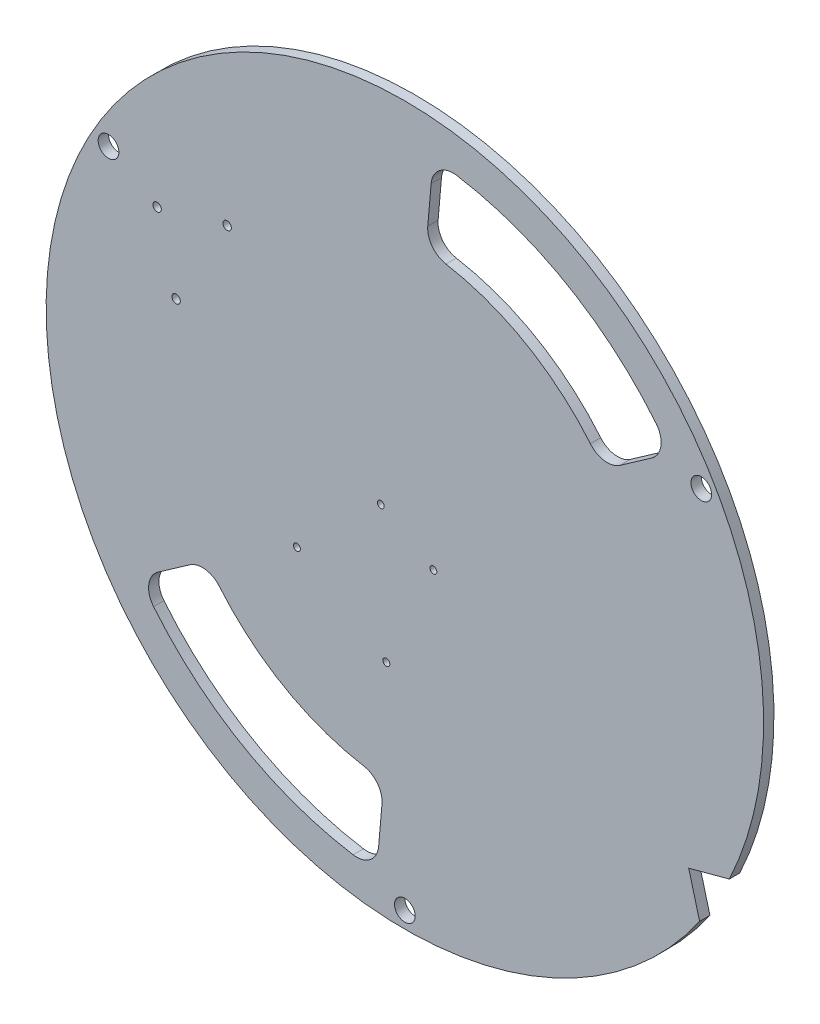
ISO-10303-21;
HEADER;
FILE_DESCRIPTION(('STEP AP214'),'2;1');
FILE_NAME('part.step','',(''),(''),'','','');
FILE_SCHEMA(('AUTOMOTIVE_DESIGN { 1 0 10303 214 1 1 1 1 }'));
ENDSEC;
DATA;
#1=APPLICATION_CONTEXT('core data for automotive mechanical design processes');
#2=APPLICATION_PROTOCOL_DEFINITION('international standard','automotive_design',2000,#1);
#3=PRODUCT_CONTEXT('',#1,'mechanical');
#4=PRODUCT('Part','Part','',(#3));
#5=PRODUCT_RELATED_PRODUCT_CATEGORY('part','',(#4));
#6=PRODUCT_DEFINITION_FORMATION('','',#4);
#7=PRODUCT_DEFINITION_CONTEXT('part definition',#1,'design');
#8=PRODUCT_DEFINITION('design','',#6,#7);
#9=PRODUCT_DEFINITION_SHAPE('','',#8);
#10=(LENGTH_UNIT() NAMED_UNIT(*) SI_UNIT(.MILLI.,.METRE.));
#11=(NAMED_UNIT(*) PLANE_ANGLE_UNIT() SI_UNIT($,.RADIAN.));
#12=(NAMED_UNIT(*) SI_UNIT($,.STERADIAN.) SOLID_ANGLE_UNIT());
#13=UNCERTAINTY_MEASURE_WITH_UNIT(LENGTH_MEASURE(1.E-05),#10,'distance_accuracy_value','');
#14=(GEOMETRIC_REPRESENTATION_CONTEXT(3) GLOBAL_UNCERTAINTY_ASSIGNED_CONTEXT((#13)) GLOBAL_UNIT_ASSIGNED_CONTEXT((#10,
#11,#12)) REPRESENTATION_CONTEXT('',''));
#15=CARTESIAN_POINT('',(0.,0.,0.));
#16=DIRECTION('',(0.,0.,1.));
#17=DIRECTION('',(1.,0.,0.));
#18=AXIS2_PLACEMENT_3D('',#15,#16,#17);
#19=CARTESIAN_POINT('',(0.,0.,4.762));
#20=DIRECTION('',(0.,0.,-1.));
#21=DIRECTION('',(-1.,0.,0.));
#22=AXIS2_PLACEMENT_3D('',#19,#20,#21);
#23=CYLINDRICAL_SURFACE('',#22,165.1);
#24=CARTESIAN_POINT('',(0.,0.,0.));
#25=DIRECTION('',(0.,0.,1.));
#26=DIRECTION('',(1.,0.,0.));
#27=AXIS2_PLACEMENT_3D('',#24,#25,#26);
#28=CIRCLE('',#27,165.1);
#29=CARTESIAN_POINT('',(149.333554499948,-70.4095128545209,0.));
#30=VERTEX_POINT('',#29);
#31=CARTESIAN_POINT('',(135.643204050077,-94.1218954071221,0.));
#32=VERTEX_POINT('',#31);
#33=EDGE_CURVE('E382',#30,#32,#28,.T.);
#34=ORIENTED_EDGE('',*,*,#33,.T.);
#35=DIRECTION('',(0.,0.,-1.));
#36=VECTOR('',#35,1.);
#37=CARTESIAN_POINT('',(135.643204050077,-94.1218954071221,4.762));
#38=LINE('',#37,#36);
#39=CARTESIAN_POINT('',(135.643204050077,-94.1218954071221,4.762));
#40=VERTEX_POINT('',#39);
#41=EDGE_CURVE('E12',#40,#32,#38,.T.);
#42=ORIENTED_EDGE('',*,*,#41,.F.);
#43=CARTESIAN_POINT('',(0.,0.,4.762));
#44=DIRECTION('',(0.,0.,1.));
#45=DIRECTION('',(1.,0.,0.));
#46=AXIS2_PLACEMENT_3D('',#43,#44,#45);
#47=CIRCLE('',#46,165.1);
#48=CARTESIAN_POINT('',(149.333554499948,-70.4095128545209,4.762));
#49=VERTEX_POINT('',#48);
#50=EDGE_CURVE('E365',#49,#40,#47,.T.);
#51=ORIENTED_EDGE('',*,*,#50,.F.);
#52=DIRECTION('',(0.,0.,-1.));
#53=VECTOR('',#52,1.);
#54=CARTESIAN_POINT('',(149.333554499948,-70.4095128545209,4.762));
#55=LINE('',#54,#53);
#56=EDGE_CURVE('E373',#49,#30,#55,.T.);
#57=ORIENTED_EDGE('',*,*,#56,.T.);
#58=EDGE_LOOP('',(#34,#42,#51,#57));
#59=FACE_BOUND('',#58,.T.);
#60=ADVANCED_FACE('F45',(#59),#23,.T.);
#61=CARTESIAN_POINT('',(103.026358452299,27.6058295464129,4.762));
#62=DIRECTION('',(0.965925826289068,0.25881904510252,0.));
#63=DIRECTION('',(-0.25881904510252,0.965925826289068,0.));
#64=AXIS2_PLACEMENT_3D('',#61,#62,#63);
#65=PLANE('',#64);
#66=DIRECTION('',(0.25881904510252,-0.965925826289068,0.));
#67=VECTOR('',#66,1.);
#68=CARTESIAN_POINT('',(103.026358452299,27.6058295464129,0.));
#69=LINE('',#68,#67);
#70=CARTESIAN_POINT('',(130.632187998712,-75.4205289058857,0.));
#71=VERTEX_POINT('',#70);
#72=EDGE_CURVE('E386',#71,#32,#69,.T.);
#73=ORIENTED_EDGE('',*,*,#72,.F.);
#74=DIRECTION('',(0.,0.,-1.));
#75=VECTOR('',#74,1.);
#76=CARTESIAN_POINT('',(130.632187998712,-75.4205289058857,4.762));
#77=LINE('',#76,#75);
#78=CARTESIAN_POINT('',(130.632187998712,-75.4205289058857,4.762));
#79=VERTEX_POINT('',#78);
#80=EDGE_CURVE('E53',#79,#71,#77,.T.);
#81=ORIENTED_EDGE('',*,*,#80,.F.);
#82=DIRECTION('',(0.25881904510252,-0.965925826289068,0.));
#83=VECTOR('',#82,1.);
#84=CARTESIAN_POINT('',(103.026358452299,27.6058295464129,4.762));
#85=LINE('',#84,#83);
#86=EDGE_CURVE('E368',#79,#40,#85,.T.);
#87=ORIENTED_EDGE('',*,*,#86,.T.);
#88=ORIENTED_EDGE('',*,*,#41,.T.);
#89=EDGE_LOOP('',(#73,#81,#87,#88));
#90=FACE_BOUND('',#89,.T.);
#91=ADVANCED_FACE('F401',(#90),#65,.T.);
#92=CARTESIAN_POINT('',(136.399001061409,78.7499999799987,4.762));
#93=DIRECTION('',(0.,0.,-1.));
#94=DIRECTION('',(-1.,0.,0.));
#95=AXIS2_PLACEMENT_3D('',#92,#93,#94);
#96=CYLINDRICAL_SURFACE('',#95,4.76250000002167);
#97=CARTESIAN_POINT('',(136.399001061409,78.7499999799987,4.762));
#98=DIRECTION('',(0.,0.,1.));
#99=DIRECTION('',(1.,0.,0.));
#100=AXIS2_PLACEMENT_3D('',#97,#98,#99);
#101=CIRCLE('',#100,4.76250000002167);
#102=CARTESIAN_POINT('',(141.161501061431,78.7499999799987,4.762));
#103=VERTEX_POINT('',#102);
#104=EDGE_CURVE('E361',#103,#103,#101,.T.);
#105=ORIENTED_EDGE('',*,*,#104,.T.);
#106=EDGE_LOOP('',(#105));
#107=FACE_BOUND('',#106,.T.);
#108=CARTESIAN_POINT('',(136.399001061409,78.7499999799987,0.));
#109=DIRECTION('',(0.,0.,1.));
#110=DIRECTION('',(1.,0.,0.));
#111=AXIS2_PLACEMENT_3D('',#108,#109,#110);
#112=CIRCLE('',#111,4.76250000002167);
#113=CARTESIAN_POINT('',(141.161501061431,78.7499999799987,0.));
#114=VERTEX_POINT('',#113);
#115=EDGE_CURVE('E379',#114,#114,#112,.T.);
#116=ORIENTED_EDGE('',*,*,#115,.F.);
#117=EDGE_LOOP('',(#116));
#118=FACE_BOUND('',#117,.T.);
#119=ADVANCED_FACE('F424',(#107,#118),#96,.F.);
#120=CARTESIAN_POINT('',(0.,-157.49999996,4.762));
#121=DIRECTION('',(0.,0.,-1.));
#122=DIRECTION('',(-1.,0.,0.));
#123=AXIS2_PLACEMENT_3D('',#120,#121,#122);
#124=CYLINDRICAL_SURFACE('',#123,4.76250000002168);
#125=CARTESIAN_POINT('',(0.,-157.49999996,4.762));
#126=DIRECTION('',(0.,0.,1.));
#127=DIRECTION('',(1.,0.,0.));
#128=AXIS2_PLACEMENT_3D('',#125,#126,#127);
#129=CIRCLE('',#128,4.76250000002168);
#130=CARTESIAN_POINT('',(4.7625000000217,-157.49999996,4.762));
#131=VERTEX_POINT('',#130);
#132=EDGE_CURVE('E356',#131,#131,#129,.T.);
#133=ORIENTED_EDGE('',*,*,#132,.T.);
#134=EDGE_LOOP('',(#133));
#135=FACE_BOUND('',#134,.T.);
#136=CARTESIAN_POINT('',(0.,-157.49999996,0.));
#137=DIRECTION('',(0.,0.,1.));
#138=DIRECTION('',(1.,0.,0.));
#139=AXIS2_PLACEMENT_3D('',#136,#137,#138);
#140=CIRCLE('',#139,4.76250000002168);
#141=CARTESIAN_POINT('',(4.7625000000217,-157.49999996,0.));
#142=VERTEX_POINT('',#141);
#143=EDGE_CURVE('E376',#142,#142,#140,.T.);
#144=ORIENTED_EDGE('',*,*,#143,.F.);
#145=EDGE_LOOP('',(#144));
#146=FACE_BOUND('',#145,.T.);
#147=ADVANCED_FACE('F428',(#135,#146),#124,.F.);
#148=CARTESIAN_POINT('',(-136.399001061408,78.7499999800007,4.762));
#149=DIRECTION('',(0.,0.,-1.));
#150=DIRECTION('',(-1.,0.,0.));
#151=AXIS2_PLACEMENT_3D('',#148,#149,#150);
#152=CYLINDRICAL_SURFACE('',#151,4.7625000000217);
#153=CARTESIAN_POINT('',(-136.399001061408,78.7499999800007,4.762));
#154=DIRECTION('',(0.,0.,1.));
#155=DIRECTION('',(1.,0.,0.));
#156=AXIS2_PLACEMENT_3D('',#153,#154,#155);
#157=CIRCLE('',#156,4.7625000000217);
#158=CARTESIAN_POINT('',(-131.636501061386,78.7499999800007,4.762));
#159=VERTEX_POINT('',#158);
#160=EDGE_CURVE('E352',#159,#159,#157,.T.);
#161=ORIENTED_EDGE('',*,*,#160,.T.);
#162=EDGE_LOOP('',(#161));
#163=FACE_BOUND('',#162,.T.);
#164=CARTESIAN_POINT('',(-136.399001061408,78.7499999800007,0.));
#165=DIRECTION('',(0.,0.,1.));
#166=DIRECTION('',(1.,0.,0.));
#167=AXIS2_PLACEMENT_3D('',#164,#165,#166);
#168=CIRCLE('',#167,4.7625000000217);
#169=CARTESIAN_POINT('',(-131.636501061386,78.7499999800007,0.));
#170=VERTEX_POINT('',#169);
#171=EDGE_CURVE('E349',#170,#170,#168,.T.);
#172=ORIENTED_EDGE('',*,*,#171,.F.);
#173=EDGE_LOOP('',(#172));
#174=FACE_BOUND('',#173,.T.);
#175=ADVANCED_FACE('F47',(#163,#174),#152,.F.);
#176=CARTESIAN_POINT('',(27.6058295464135,-103.026358452299,4.762));
#177=DIRECTION('',(-0.258819045102526,0.965925826289067,0.));
#178=DIRECTION('',(-0.965925826289067,-0.258819045102526,0.));
#179=AXIS2_PLACEMENT_3D('',#176,#177,#178);
#180=PLANE('',#179);
#181=DIRECTION('',(0.965925826289067,0.258819045102526,0.));
#182=VECTOR('',#181,1.);
#183=CARTESIAN_POINT('',(27.6058295464135,-103.026358452299,0.));
#184=LINE('',#183,#182);
#185=EDGE_CURVE('E357',#71,#30,#184,.T.);
#186=ORIENTED_EDGE('',*,*,#185,.T.);
#187=ORIENTED_EDGE('',*,*,#56,.F.);
#188=DIRECTION('',(0.965925826289067,0.258819045102526,0.));
#189=VECTOR('',#188,1.);
#190=CARTESIAN_POINT('',(27.6058295464135,-103.026358452299,4.762));
#191=LINE('',#190,#189);
#192=EDGE_CURVE('E371',#79,#49,#191,.T.);
#193=ORIENTED_EDGE('',*,*,#192,.F.);
#194=ORIENTED_EDGE('',*,*,#80,.T.);
#195=EDGE_LOOP('',(#186,#187,#193,#194));
#196=FACE_BOUND('',#195,.T.);
#197=ADVANCED_FACE('F394',(#196),#180,.F.);
#198=CARTESIAN_POINT('',(0.,0.,4.762));
#199=DIRECTION('',(0.,0.,1.));
#200=DIRECTION('',(1.,0.,0.));
#201=AXIS2_PLACEMENT_3D('',#198,#199,#200);
#202=PLANE('',#201);
#203=CARTESIAN_POINT('',(-93.1741154605542,-77.6442878333191,4.762));
#204=DIRECTION('',(0.,0.,1.));
#205=DIRECTION('',(-1.,0.,0.));
#206=AXIS2_PLACEMENT_3D('',#203,#204,#205);
#207=CIRCLE('',#206,10.16);
#208=CARTESIAN_POINT('',(-85.3689539560051,-71.1400542975437,4.762));
#209=VERTEX_POINT('',#208);
#210=CARTESIAN_POINT('',(-99.0016520538809,-69.321703063343,4.762));
#211=VERTEX_POINT('',#210);
#212=EDGE_CURVE('E60',#209,#211,#207,.T.);
#213=ORIENTED_EDGE('',*,*,#212,.F.);
#214=CARTESIAN_POINT('',(0.,0.,4.762));
#215=DIRECTION('',(0.,0.,-1.));
#216=DIRECTION('',(-1.,0.,0.));
#217=AXIS2_PLACEMENT_3D('',#214,#215,#216);
#218=CIRCLE('',#217,111.125);
#219=CARTESIAN_POINT('',(-18.9246172702747,-109.501709969176,4.762));
#220=VERTEX_POINT('',#219);
#221=EDGE_CURVE('E194',#220,#209,#218,.T.);
#222=ORIENTED_EDGE('',*,*,#221,.F.);
#223=CARTESIAN_POINT('',(-20.6548679921284,-119.513294880644,4.762));
#224=DIRECTION('',(0.,0.,1.));
#225=DIRECTION('',(1.,0.,0.));
#226=AXIS2_PLACEMENT_3D('',#223,#224,#225);
#227=CIRCLE('',#226,10.16);
#228=CARTESIAN_POINT('',(-10.5335298595163,-120.39879722696,4.762));
#229=VERTEX_POINT('',#228);
#230=EDGE_CURVE('E197',#229,#220,#227,.T.);
#231=ORIENTED_EDGE('',*,*,#230,.F.);
#232=DIRECTION('',(0.0871557427476649,0.996194698091745,0.));
#233=VECTOR('',#232,1.);
#234=CARTESIAN_POINT('',(-12.0879229673841,-138.165591748939,4.762));
#235=LINE('',#234,#233);
#236=CARTESIAN_POINT('',(-12.0879229673841,-138.165591748939,4.762));
#237=VERTEX_POINT('',#236);
#238=EDGE_CURVE('E225',#237,#229,#235,.T.);
#239=ORIENTED_EDGE('',*,*,#238,.F.);
#240=CARTESIAN_POINT('',(-22.2092610999962,-137.280089402623,4.762));
#241=DIRECTION('',(0.,0.,1.));
#242=DIRECTION('',(-1.,0.,0.));
#243=AXIS2_PLACEMENT_3D('',#240,#241,#242);
#244=CIRCLE('',#243,10.16);
#245=CARTESIAN_POINT('',(-23.8318555182607,-147.309684975417,4.762));
#246=VERTEX_POINT('',#245);
#247=EDGE_CURVE('E222',#246,#237,#244,.T.);
#248=ORIENTED_EDGE('',*,*,#247,.F.);
#249=CARTESIAN_POINT('',(0.,0.,4.762));
#250=DIRECTION('',(0.,0.,1.));
#251=DIRECTION('',(-1.,0.,0.));
#252=AXIS2_PLACEMENT_3D('',#249,#250,#251);
#253=CIRCLE('',#252,149.225);
#254=CARTESIAN_POINT('',(-115.658001653064,-94.2938347858428,4.762));
#255=VERTEX_POINT('',#254);
#256=EDGE_CURVE('E219',#255,#246,#253,.T.);
#257=ORIENTED_EDGE('',*,*,#256,.F.);
#258=CARTESIAN_POINT('',(-107.783414306473,-87.8738290131896,4.762));
#259=DIRECTION('',(0.,0.,1.));
#260=DIRECTION('',(1.,0.,0.));
#261=AXIS2_PLACEMENT_3D('',#258,#259,#260);
#262=CIRCLE('',#261,10.16);
#263=CARTESIAN_POINT('',(-113.610950899799,-79.5512442432135,4.762));
#264=VERTEX_POINT('',#263);
#265=EDGE_CURVE('E216',#264,#255,#262,.T.);
#266=ORIENTED_EDGE('',*,*,#265,.F.);
#267=DIRECTION('',(-0.819152044288989,-0.57357643635105,0.));
#268=VECTOR('',#267,1.);
#269=CARTESIAN_POINT('',(-113.610950899799,-79.5512442432135,4.762));
#270=LINE('',#269,#268);
#271=EDGE_CURVE('E214',#211,#264,#270,.T.);
#272=ORIENTED_EDGE('',*,*,#271,.F.);
#273=EDGE_LOOP('',(#213,#222,#231,#239,#248,#257,#266,#272));
#274=FACE_BOUND('',#273,.T.);
#275=CARTESIAN_POINT('',(107.783414306472,87.8738290131905,4.762));
#276=DIRECTION('',(0.,0.,1.));
#277=DIRECTION('',(1.,0.,0.));
#278=AXIS2_PLACEMENT_3D('',#275,#276,#277);
#279=CIRCLE('',#278,10.16);
#280=CARTESIAN_POINT('',(113.610950899799,79.5512442432144,4.762));
#281=VERTEX_POINT('',#280);
#282=CARTESIAN_POINT('',(115.658001653063,94.2938347858436,4.762));
#283=VERTEX_POINT('',#282);
#284=EDGE_CURVE('E232',#281,#283,#279,.T.);
#285=ORIENTED_EDGE('',*,*,#284,.F.);
#286=DIRECTION('',(0.819152044288984,0.573576436351057,0.));
#287=VECTOR('',#286,1.);
#288=CARTESIAN_POINT('',(113.610950899799,79.5512442432144,4.762));
#289=LINE('',#288,#287);
#290=CARTESIAN_POINT('',(99.0016520538804,69.3217030633438,4.762));
#291=VERTEX_POINT('',#290);
#292=EDGE_CURVE('E248',#291,#281,#289,.T.);
#293=ORIENTED_EDGE('',*,*,#292,.F.);
#294=CARTESIAN_POINT('',(93.1741154605537,77.6442878333198,4.762));
#295=DIRECTION('',(0.,0.,1.));
#296=DIRECTION('',(-1.,0.,0.));
#297=AXIS2_PLACEMENT_3D('',#294,#295,#296);
#298=CIRCLE('',#297,10.16);
#299=CARTESIAN_POINT('',(85.3689539560046,71.1400542975443,4.762));
#300=VERTEX_POINT('',#299);
#301=EDGE_CURVE('E286',#300,#291,#298,.T.);
#302=ORIENTED_EDGE('',*,*,#301,.F.);
#303=CARTESIAN_POINT('',(0.,0.,4.762));
#304=DIRECTION('',(0.,0.,-1.));
#305=DIRECTION('',(1.,0.,0.));
#306=AXIS2_PLACEMENT_3D('',#303,#304,#305);
#307=CIRCLE('',#306,111.125);
#308=CARTESIAN_POINT('',(18.9246172702739,109.501709969176,4.762));
#309=VERTEX_POINT('',#308);
#310=EDGE_CURVE('E283',#309,#300,#307,.T.);
#311=ORIENTED_EDGE('',*,*,#310,.F.);
#312=CARTESIAN_POINT('',(20.6548679921275,119.513294880644,4.762));
#313=DIRECTION('',(0.,0.,1.));
#314=DIRECTION('',(1.,0.,0.));
#315=AXIS2_PLACEMENT_3D('',#312,#313,#314);
#316=CIRCLE('',#315,10.16);
#317=CARTESIAN_POINT('',(10.5335298595154,120.39879722696,4.762));
#318=VERTEX_POINT('',#317);
#319=EDGE_CURVE('E280',#318,#309,#316,.T.);
#320=ORIENTED_EDGE('',*,*,#319,.F.);
#321=DIRECTION('',(-0.0871557427476574,-0.996194698091746,0.));
#322=VECTOR('',#321,1.);
#323=CARTESIAN_POINT('',(12.087922967383,138.165591748939,4.762));
#324=LINE('',#323,#322);
#325=CARTESIAN_POINT('',(12.087922967383,138.165591748939,4.762));
#326=VERTEX_POINT('',#325);
#327=EDGE_CURVE('E277',#326,#318,#324,.T.);
#328=ORIENTED_EDGE('',*,*,#327,.F.);
#329=CARTESIAN_POINT('',(22.2092610999952,137.280089402623,4.762));
#330=DIRECTION('',(0.,0.,1.));
#331=DIRECTION('',(-1.,0.,0.));
#332=AXIS2_PLACEMENT_3D('',#329,#330,#331);
#333=CIRCLE('',#332,10.16);
#334=CARTESIAN_POINT('',(23.8318555182597,147.309684975418,4.762));
#335=VERTEX_POINT('',#334);
#336=EDGE_CURVE('E274',#335,#326,#333,.T.);
#337=ORIENTED_EDGE('',*,*,#336,.F.);
#338=CARTESIAN_POINT('',(0.,0.,4.762));
#339=DIRECTION('',(0.,0.,1.));
#340=DIRECTION('',(1.,0.,0.));
#341=AXIS2_PLACEMENT_3D('',#338,#339,#340);
#342=CIRCLE('',#341,149.225);
#343=EDGE_CURVE('E271',#283,#335,#342,.T.);
#344=ORIENTED_EDGE('',*,*,#343,.F.);
#345=EDGE_LOOP('',(#285,#293,#302,#311,#320,#328,#337,#344));
#346=FACE_BOUND('',#345,.T.);
#347=CARTESIAN_POINT('',(-49.6807000225601,-37.6815093946631,4.762));
#348=DIRECTION('',(0.,0.,-1.));
#349=DIRECTION('',(-1.,0.,0.));
#350=AXIS2_PLACEMENT_3D('',#347,#348,#349);
#351=CIRCLE('',#350,1.58749999999996);
#352=CARTESIAN_POINT('',(-51.2682000225601,-37.6815093946631,4.762));
#353=VERTEX_POINT('',#352);
#354=EDGE_CURVE('E293',#353,#353,#351,.T.);
#355=ORIENTED_EDGE('',*,*,#354,.T.);
#356=EDGE_LOOP('',(#355));
#357=FACE_BOUND('',#356,.T.);
#358=CARTESIAN_POINT('',(-11.0824728688855,-1.30741888241334,4.762));
#359=DIRECTION('',(0.,0.,-1.));
#360=DIRECTION('',(-1.,0.,0.));
#361=AXIS2_PLACEMENT_3D('',#358,#359,#360);
#362=CIRCLE('',#361,1.5875);
#363=CARTESIAN_POINT('',(-12.6699728688855,-1.30741888241334,4.762));
#364=VERTEX_POINT('',#363);
#365=EDGE_CURVE('E312',#364,#364,#362,.T.);
#366=ORIENTED_EDGE('',*,*,#365,.T.);
#367=EDGE_LOOP('',(#366));
#368=FACE_BOUND('',#367,.T.);
#369=CARTESIAN_POINT('',(-8.52131403592293,-62.9113616574691,4.762));
#370=DIRECTION('',(0.,0.,-1.));
#371=DIRECTION('',(-1.,0.,0.));
#372=AXIS2_PLACEMENT_3D('',#369,#370,#371);
#373=CIRCLE('',#372,1.5875);
#374=CARTESIAN_POINT('',(-10.1088140359229,-62.9113616574691,4.762));
#375=VERTEX_POINT('',#374);
#376=EDGE_CURVE('E319',#375,#375,#373,.T.);
#377=ORIENTED_EDGE('',*,*,#376,.T.);
#378=EDGE_LOOP('',(#377));
#379=FACE_BOUND('',#378,.T.);
#380=CARTESIAN_POINT('',(13.1142769128518,-15.2774188824132,4.762));
#381=DIRECTION('',(0.,0.,-1.));
#382=DIRECTION('',(-1.,0.,0.));
#383=AXIS2_PLACEMENT_3D('',#380,#381,#382);
#384=CIRCLE('',#383,1.58750000000002);
#385=CARTESIAN_POINT('',(11.5267769128518,-15.2774188824132,4.762));
#386=VERTEX_POINT('',#385);
#387=EDGE_CURVE('E328',#386,#386,#384,.T.);
#388=ORIENTED_EDGE('',*,*,#387,.T.);
#389=EDGE_LOOP('',(#388));
#390=FACE_BOUND('',#389,.T.);
#391=CARTESIAN_POINT('',(-105.284682975911,33.5098039400958,4.762));
#392=DIRECTION('',(0.,0.,1.));
#393=DIRECTION('',(1.,0.,0.));
#394=AXIS2_PLACEMENT_3D('',#391,#392,#393);
#395=CIRCLE('',#394,1.93040000000247);
#396=CARTESIAN_POINT('',(-103.354282975908,33.5098039400958,4.762));
#397=VERTEX_POINT('',#396);
#398=EDGE_CURVE('E331',#397,#397,#395,.T.);
#399=ORIENTED_EDGE('',*,*,#398,.F.);
#400=EDGE_LOOP('',(#399));
#401=FACE_BOUND('',#400,.T.);
#402=CARTESIAN_POINT('',(-81.7768042882983,74.4901960869103,4.762));
#403=DIRECTION('',(0.,0.,1.));
#404=DIRECTION('',(1.,0.,0.));
#405=AXIS2_PLACEMENT_3D('',#402,#403,#404);
#406=CIRCLE('',#405,1.93040000000862);
#407=CARTESIAN_POINT('',(-79.8464042882896,74.4901960869103,4.762));
#408=VERTEX_POINT('',#407);
#409=EDGE_CURVE('E337',#408,#408,#406,.T.);
#410=ORIENTED_EDGE('',*,*,#409,.F.);
#411=EDGE_LOOP('',(#410));
#412=FACE_BOUND('',#411,.T.);
#413=CARTESIAN_POINT('',(-114.020939705512,65.75393935731,4.762));
#414=DIRECTION('',(0.,0.,1.));
#415=DIRECTION('',(1.,0.,0.));
#416=AXIS2_PLACEMENT_3D('',#413,#414,#415);
#417=CIRCLE('',#416,1.93040000000797);
#418=CARTESIAN_POINT('',(-112.090539705504,65.75393935731,4.762));
#419=VERTEX_POINT('',#418);
#420=EDGE_CURVE('E343',#419,#419,#417,.T.);
#421=ORIENTED_EDGE('',*,*,#420,.F.);
#422=EDGE_LOOP('',(#421));
#423=FACE_BOUND('',#422,.T.);
#424=ORIENTED_EDGE('',*,*,#160,.F.);
#425=EDGE_LOOP('',(#424));
#426=FACE_BOUND('',#425,.T.);
#427=ORIENTED_EDGE('',*,*,#132,.F.);
#428=EDGE_LOOP('',(#427));
#429=FACE_BOUND('',#428,.T.);
#430=ORIENTED_EDGE('',*,*,#104,.F.);
#431=EDGE_LOOP('',(#430));
#432=FACE_BOUND('',#431,.T.);
#433=ORIENTED_EDGE('',*,*,#50,.T.);
#434=ORIENTED_EDGE('',*,*,#86,.F.);
#435=ORIENTED_EDGE('',*,*,#192,.T.);
#436=EDGE_LOOP('',(#433,#434,#435));
#437=FACE_BOUND('',#436,.T.);
#438=ADVANCED_FACE('F406',(#274,#346,#357,#368,#379,#390,#401,#412,#423,#426,#429,#432,#437),
#202,.T.);
#439=CARTESIAN_POINT('',(0.,0.,0.));
#440=DIRECTION('',(0.,0.,1.));
#441=DIRECTION('',(1.,0.,0.));
#442=AXIS2_PLACEMENT_3D('',#439,#440,#441);
#443=PLANE('',#442);
#444=CARTESIAN_POINT('',(0.,0.,0.));
#445=DIRECTION('',(0.,0.,-1.));
#446=DIRECTION('',(-1.,0.,0.));
#447=AXIS2_PLACEMENT_3D('',#444,#445,#446);
#448=CIRCLE('',#447,111.125);
#449=CARTESIAN_POINT('',(-18.9246172702747,-109.501709969176,0.));
#450=VERTEX_POINT('',#449);
#451=CARTESIAN_POINT('',(-85.3689539560051,-71.1400542975437,0.));
#452=VERTEX_POINT('',#451);
#453=EDGE_CURVE('E183',#450,#452,#448,.T.);
#454=ORIENTED_EDGE('',*,*,#453,.T.);
#455=CARTESIAN_POINT('',(-93.1741154605542,-77.6442878333191,0.));
#456=DIRECTION('',(0.,0.,1.));
#457=DIRECTION('',(-1.,0.,0.));
#458=AXIS2_PLACEMENT_3D('',#455,#456,#457);
#459=CIRCLE('',#458,10.16);
#460=CARTESIAN_POINT('',(-99.0016520538809,-69.321703063343,0.));
#461=VERTEX_POINT('',#460);
#462=EDGE_CURVE('E177',#452,#461,#459,.T.);
#463=ORIENTED_EDGE('',*,*,#462,.T.);
#464=DIRECTION('',(-0.819152044288989,-0.57357643635105,0.));
#465=VECTOR('',#464,1.);
#466=CARTESIAN_POINT('',(-113.610950899799,-79.5512442432135,0.));
#467=LINE('',#466,#465);
#468=CARTESIAN_POINT('',(-113.610950899799,-79.5512442432135,0.));
#469=VERTEX_POINT('',#468);
#470=EDGE_CURVE('E186',#461,#469,#467,.T.);
#471=ORIENTED_EDGE('',*,*,#470,.T.);
#472=CARTESIAN_POINT('',(-107.783414306473,-87.8738290131896,0.));
#473=DIRECTION('',(0.,0.,1.));
#474=DIRECTION('',(1.,0.,0.));
#475=AXIS2_PLACEMENT_3D('',#472,#473,#474);
#476=CIRCLE('',#475,10.16);
#477=CARTESIAN_POINT('',(-115.658001653064,-94.2938347858428,0.));
#478=VERTEX_POINT('',#477);
#479=EDGE_CURVE('E68',#469,#478,#476,.T.);
#480=ORIENTED_EDGE('',*,*,#479,.T.);
#481=CARTESIAN_POINT('',(0.,0.,0.));
#482=DIRECTION('',(0.,0.,1.));
#483=DIRECTION('',(-1.,0.,0.));
#484=AXIS2_PLACEMENT_3D('',#481,#482,#483);
#485=CIRCLE('',#484,149.225);
#486=CARTESIAN_POINT('',(-23.8318555182607,-147.309684975417,0.));
#487=VERTEX_POINT('',#486);
#488=EDGE_CURVE('E201',#478,#487,#485,.T.);
#489=ORIENTED_EDGE('',*,*,#488,.T.);
#490=CARTESIAN_POINT('',(-22.2092610999962,-137.280089402623,0.));
#491=DIRECTION('',(0.,0.,1.));
#492=DIRECTION('',(-1.,0.,0.));
#493=AXIS2_PLACEMENT_3D('',#490,#491,#492);
#494=CIRCLE('',#493,10.16);
#495=CARTESIAN_POINT('',(-12.0879229673841,-138.165591748939,0.));
#496=VERTEX_POINT('',#495);
#497=EDGE_CURVE('E204',#487,#496,#494,.T.);
#498=ORIENTED_EDGE('',*,*,#497,.T.);
#499=DIRECTION('',(0.0871557427476649,0.996194698091745,0.));
#500=VECTOR('',#499,1.);
#501=CARTESIAN_POINT('',(-12.0879229673841,-138.165591748939,0.));
#502=LINE('',#501,#500);
#503=CARTESIAN_POINT('',(-10.5335298595163,-120.39879722696,0.));
#504=VERTEX_POINT('',#503);
#505=EDGE_CURVE('E207',#496,#504,#502,.T.);
#506=ORIENTED_EDGE('',*,*,#505,.T.);
#507=CARTESIAN_POINT('',(-20.6548679921284,-119.513294880644,0.));
#508=DIRECTION('',(0.,0.,1.));
#509=DIRECTION('',(1.,0.,0.));
#510=AXIS2_PLACEMENT_3D('',#507,#508,#509);
#511=CIRCLE('',#510,10.16);
#512=EDGE_CURVE('E210',#504,#450,#511,.T.);
#513=ORIENTED_EDGE('',*,*,#512,.T.);
#514=EDGE_LOOP('',(#454,#463,#471,#480,#489,#498,#506,#513));
#515=FACE_BOUND('',#514,.T.);
#516=DIRECTION('',(0.819152044288984,0.573576436351057,0.));
#517=VECTOR('',#516,1.);
#518=CARTESIAN_POINT('',(113.610950899799,79.5512442432144,0.));
#519=LINE('',#518,#517);
#520=CARTESIAN_POINT('',(99.0016520538804,69.3217030633438,0.));
#521=VERTEX_POINT('',#520);
#522=CARTESIAN_POINT('',(113.610950899799,79.5512442432144,0.));
#523=VERTEX_POINT('',#522);
#524=EDGE_CURVE('E266',#521,#523,#519,.T.);
#525=ORIENTED_EDGE('',*,*,#524,.T.);
#526=CARTESIAN_POINT('',(107.783414306472,87.8738290131905,0.));
#527=DIRECTION('',(0.,0.,1.));
#528=DIRECTION('',(1.,0.,0.));
#529=AXIS2_PLACEMENT_3D('',#526,#527,#528);
#530=CIRCLE('',#529,10.16);
#531=CARTESIAN_POINT('',(115.658001653063,94.2938347858436,0.));
#532=VERTEX_POINT('',#531);
#533=EDGE_CURVE('E244',#523,#532,#530,.T.);
#534=ORIENTED_EDGE('',*,*,#533,.T.);
#535=CARTESIAN_POINT('',(0.,0.,0.));
#536=DIRECTION('',(0.,0.,1.));
#537=DIRECTION('',(1.,0.,0.));
#538=AXIS2_PLACEMENT_3D('',#535,#536,#537);
#539=CIRCLE('',#538,149.225);
#540=CARTESIAN_POINT('',(23.8318555182597,147.309684975418,0.));
#541=VERTEX_POINT('',#540);
#542=EDGE_CURVE('E247',#532,#541,#539,.T.);
#543=ORIENTED_EDGE('',*,*,#542,.T.);
#544=CARTESIAN_POINT('',(22.2092610999952,137.280089402623,0.));
#545=DIRECTION('',(0.,0.,1.));
#546=DIRECTION('',(-1.,0.,0.));
#547=AXIS2_PLACEMENT_3D('',#544,#545,#546);
#548=CIRCLE('',#547,10.16);
#549=CARTESIAN_POINT('',(12.087922967383,138.165591748939,0.));
#550=VERTEX_POINT('',#549);
#551=EDGE_CURVE('E251',#541,#550,#548,.T.);
#552=ORIENTED_EDGE('',*,*,#551,.T.);
#553=DIRECTION('',(-0.0871557427476574,-0.996194698091746,0.));
#554=VECTOR('',#553,1.);
#555=CARTESIAN_POINT('',(12.087922967383,138.165591748939,0.));
#556=LINE('',#555,#554);
#557=CARTESIAN_POINT('',(10.5335298595154,120.39879722696,0.));
#558=VERTEX_POINT('',#557);
#559=EDGE_CURVE('E254',#550,#558,#556,.T.);
#560=ORIENTED_EDGE('',*,*,#559,.T.);
#561=CARTESIAN_POINT('',(20.6548679921275,119.513294880644,0.));
#562=DIRECTION('',(0.,0.,1.));
#563=DIRECTION('',(1.,0.,0.));
#564=AXIS2_PLACEMENT_3D('',#561,#562,#563);
#565=CIRCLE('',#564,10.16);
#566=CARTESIAN_POINT('',(18.9246172702739,109.501709969176,0.));
#567=VERTEX_POINT('',#566);
#568=EDGE_CURVE('E257',#558,#567,#565,.T.);
#569=ORIENTED_EDGE('',*,*,#568,.T.);
#570=CARTESIAN_POINT('',(0.,0.,0.));
#571=DIRECTION('',(0.,0.,-1.));
#572=DIRECTION('',(1.,0.,0.));
#573=AXIS2_PLACEMENT_3D('',#570,#571,#572);
#574=CIRCLE('',#573,111.125);
#575=CARTESIAN_POINT('',(85.3689539560046,71.1400542975443,0.));
#576=VERTEX_POINT('',#575);
#577=EDGE_CURVE('E260',#567,#576,#574,.T.);
#578=ORIENTED_EDGE('',*,*,#577,.T.);
#579=CARTESIAN_POINT('',(93.1741154605537,77.6442878333198,0.));
#580=DIRECTION('',(0.,0.,1.));
#581=DIRECTION('',(-1.,0.,0.));
#582=AXIS2_PLACEMENT_3D('',#579,#580,#581);
#583=CIRCLE('',#582,10.16);
#584=EDGE_CURVE('E263',#576,#521,#583,.T.);
#585=ORIENTED_EDGE('',*,*,#584,.T.);
#586=EDGE_LOOP('',(#525,#534,#543,#552,#560,#569,#578,#585));
#587=FACE_BOUND('',#586,.T.);
#588=CARTESIAN_POINT('',(-49.6807000225601,-37.6815093946631,0.));
#589=DIRECTION('',(0.,0.,-1.));
#590=DIRECTION('',(-1.,0.,0.));
#591=AXIS2_PLACEMENT_3D('',#588,#589,#590);
#592=CIRCLE('',#591,1.58749999999996);
#593=CARTESIAN_POINT('',(-51.2682000225601,-37.6815093946631,0.));
#594=VERTEX_POINT('',#593);
#595=EDGE_CURVE('E308',#594,#594,#592,.T.);
#596=ORIENTED_EDGE('',*,*,#595,.F.);
#597=EDGE_LOOP('',(#596));
#598=FACE_BOUND('',#597,.T.);
#599=CARTESIAN_POINT('',(-11.0824728688855,-1.30741888241334,0.));
#600=DIRECTION('',(0.,0.,-1.));
#601=DIRECTION('',(-1.,0.,0.));
#602=AXIS2_PLACEMENT_3D('',#599,#600,#601);
#603=CIRCLE('',#602,1.5875);
#604=CARTESIAN_POINT('',(-12.6699728688855,-1.30741888241334,0.));
#605=VERTEX_POINT('',#604);
#606=EDGE_CURVE('E316',#605,#605,#603,.T.);
#607=ORIENTED_EDGE('',*,*,#606,.F.);
#608=EDGE_LOOP('',(#607));
#609=FACE_BOUND('',#608,.T.);
#610=CARTESIAN_POINT('',(-8.52131403592293,-62.9113616574691,0.));
#611=DIRECTION('',(0.,0.,-1.));
#612=DIRECTION('',(-1.,0.,0.));
#613=AXIS2_PLACEMENT_3D('',#610,#611,#612);
#614=CIRCLE('',#613,1.5875);
#615=CARTESIAN_POINT('',(-10.1088140359229,-62.9113616574691,0.));
#616=VERTEX_POINT('',#615);
#617=EDGE_CURVE('E322',#616,#616,#614,.T.);
#618=ORIENTED_EDGE('',*,*,#617,.F.);
#619=EDGE_LOOP('',(#618));
#620=FACE_BOUND('',#619,.T.);
#621=CARTESIAN_POINT('',(13.1142769128518,-15.2774188824132,0.));
#622=DIRECTION('',(0.,0.,-1.));
#623=DIRECTION('',(-1.,0.,0.));
#624=AXIS2_PLACEMENT_3D('',#621,#622,#623);
#625=CIRCLE('',#624,1.58750000000002);
#626=CARTESIAN_POINT('',(11.5267769128518,-15.2774188824132,0.));
#627=VERTEX_POINT('',#626);
#628=EDGE_CURVE('E325',#627,#627,#625,.T.);
#629=ORIENTED_EDGE('',*,*,#628,.F.);
#630=EDGE_LOOP('',(#629));
#631=FACE_BOUND('',#630,.T.);
#632=CARTESIAN_POINT('',(-105.284682975911,33.5098039400958,0.));
#633=DIRECTION('',(0.,0.,1.));
#634=DIRECTION('',(1.,0.,0.));
#635=AXIS2_PLACEMENT_3D('',#632,#633,#634);
#636=CIRCLE('',#635,1.93040000000247);
#637=CARTESIAN_POINT('',(-103.354282975908,33.5098039400958,0.));
#638=VERTEX_POINT('',#637);
#639=EDGE_CURVE('E334',#638,#638,#636,.T.);
#640=ORIENTED_EDGE('',*,*,#639,.T.);
#641=EDGE_LOOP('',(#640));
#642=FACE_BOUND('',#641,.T.);
#643=CARTESIAN_POINT('',(-81.7768042882983,74.4901960869103,0.));
#644=DIRECTION('',(0.,0.,1.));
#645=DIRECTION('',(1.,0.,0.));
#646=AXIS2_PLACEMENT_3D('',#643,#644,#645);
#647=CIRCLE('',#646,1.93040000000862);
#648=CARTESIAN_POINT('',(-79.8464042882896,74.4901960869103,0.));
#649=VERTEX_POINT('',#648);
#650=EDGE_CURVE('E340',#649,#649,#647,.T.);
#651=ORIENTED_EDGE('',*,*,#650,.T.);
#652=EDGE_LOOP('',(#651));
#653=FACE_BOUND('',#652,.T.);
#654=CARTESIAN_POINT('',(-114.020939705512,65.75393935731,0.));
#655=DIRECTION('',(0.,0.,1.));
#656=DIRECTION('',(1.,0.,0.));
#657=AXIS2_PLACEMENT_3D('',#654,#655,#656);
#658=CIRCLE('',#657,1.93040000000797);
#659=CARTESIAN_POINT('',(-112.090539705504,65.75393935731,0.));
#660=VERTEX_POINT('',#659);
#661=EDGE_CURVE('E346',#660,#660,#658,.T.);
#662=ORIENTED_EDGE('',*,*,#661,.T.);
#663=EDGE_LOOP('',(#662));
#664=FACE_BOUND('',#663,.T.);
#665=ORIENTED_EDGE('',*,*,#171,.T.);
#666=EDGE_LOOP('',(#665));
#667=FACE_BOUND('',#666,.T.);
#668=ORIENTED_EDGE('',*,*,#143,.T.);
#669=EDGE_LOOP('',(#668));
#670=FACE_BOUND('',#669,.T.);
#671=ORIENTED_EDGE('',*,*,#115,.T.);
#672=EDGE_LOOP('',(#671));
#673=FACE_BOUND('',#672,.T.);
#674=ORIENTED_EDGE('',*,*,#33,.F.);
#675=ORIENTED_EDGE('',*,*,#185,.F.);
#676=ORIENTED_EDGE('',*,*,#72,.T.);
#677=EDGE_LOOP('',(#674,#675,#676));
#678=FACE_BOUND('',#677,.T.);
#679=ADVANCED_FACE('F190',(#515,#587,#598,#609,#620,#631,#642,#653,#664,#667,#670,#673,#678),
#443,.F.);
#680=CARTESIAN_POINT('',(-114.020939705512,65.75393935731,0.));
#681=DIRECTION('',(0.,0.,1.));
#682=DIRECTION('',(1.,0.,0.));
#683=AXIS2_PLACEMENT_3D('',#680,#681,#682);
#684=CYLINDRICAL_SURFACE('',#683,1.93040000000797);
#685=ORIENTED_EDGE('',*,*,#661,.F.);
#686=EDGE_LOOP('',(#685));
#687=FACE_BOUND('',#686,.T.);
#688=ORIENTED_EDGE('',*,*,#420,.T.);
#689=EDGE_LOOP('',(#688));
#690=FACE_BOUND('',#689,.T.);
#691=ADVANCED_FACE('F414',(#687,#690),#684,.F.);
#692=CARTESIAN_POINT('',(-81.7768042882983,74.4901960869103,0.));
#693=DIRECTION('',(0.,0.,1.));
#694=DIRECTION('',(1.,0.,0.));
#695=AXIS2_PLACEMENT_3D('',#692,#693,#694);
#696=CYLINDRICAL_SURFACE('',#695,1.93040000000862);
#697=ORIENTED_EDGE('',*,*,#650,.F.);
#698=EDGE_LOOP('',(#697));
#699=FACE_BOUND('',#698,.T.);
#700=ORIENTED_EDGE('',*,*,#409,.T.);
#701=EDGE_LOOP('',(#700));
#702=FACE_BOUND('',#701,.T.);
#703=ADVANCED_FACE('F471',(#699,#702),#696,.F.);
#704=CARTESIAN_POINT('',(-105.284682975911,33.5098039400958,0.));
#705=DIRECTION('',(0.,0.,1.));
#706=DIRECTION('',(1.,0.,0.));
#707=AXIS2_PLACEMENT_3D('',#704,#705,#706);
#708=CYLINDRICAL_SURFACE('',#707,1.93040000000247);
#709=ORIENTED_EDGE('',*,*,#639,.F.);
#710=EDGE_LOOP('',(#709));
#711=FACE_BOUND('',#710,.T.);
#712=ORIENTED_EDGE('',*,*,#398,.T.);
#713=EDGE_LOOP('',(#712));
#714=FACE_BOUND('',#713,.T.);
#715=ADVANCED_FACE('F481',(#711,#714),#708,.F.);
#716=CARTESIAN_POINT('',(13.1142769128518,-15.2774188824132,4.762));
#717=DIRECTION('',(0.,0.,-1.));
#718=DIRECTION('',(-1.,0.,0.));
#719=AXIS2_PLACEMENT_3D('',#716,#717,#718);
#720=CYLINDRICAL_SURFACE('',#719,1.58750000000002);
#721=ORIENTED_EDGE('',*,*,#387,.F.);
#722=EDGE_LOOP('',(#721));
#723=FACE_BOUND('',#722,.T.);
#724=ORIENTED_EDGE('',*,*,#628,.T.);
#725=EDGE_LOOP('',(#724));
#726=FACE_BOUND('',#725,.T.);
#727=ADVANCED_FACE('F491',(#723,#726),#720,.F.);
#728=CARTESIAN_POINT('',(-8.52131403592293,-62.9113616574691,4.762));
#729=DIRECTION('',(0.,0.,-1.));
#730=DIRECTION('',(-1.,0.,0.));
#731=AXIS2_PLACEMENT_3D('',#728,#729,#730);
#732=CYLINDRICAL_SURFACE('',#731,1.5875);
#733=ORIENTED_EDGE('',*,*,#376,.F.);
#734=EDGE_LOOP('',(#733));
#735=FACE_BOUND('',#734,.T.);
#736=ORIENTED_EDGE('',*,*,#617,.T.);
#737=EDGE_LOOP('',(#736));
#738=FACE_BOUND('',#737,.T.);
#739=ADVANCED_FACE('F502',(#735,#738),#732,.F.);
#740=CARTESIAN_POINT('',(-11.0824728688855,-1.30741888241334,4.762));
#741=DIRECTION('',(0.,0.,-1.));
#742=DIRECTION('',(-1.,0.,0.));
#743=AXIS2_PLACEMENT_3D('',#740,#741,#742);
#744=CYLINDRICAL_SURFACE('',#743,1.5875);
#745=ORIENTED_EDGE('',*,*,#365,.F.);
#746=EDGE_LOOP('',(#745));
#747=FACE_BOUND('',#746,.T.);
#748=ORIENTED_EDGE('',*,*,#606,.T.);
#749=EDGE_LOOP('',(#748));
#750=FACE_BOUND('',#749,.T.);
#751=ADVANCED_FACE('F512',(#747,#750),#744,.F.);
#752=CARTESIAN_POINT('',(-49.6807000225601,-37.6815093946631,4.762));
#753=DIRECTION('',(0.,0.,-1.));
#754=DIRECTION('',(-1.,0.,0.));
#755=AXIS2_PLACEMENT_3D('',#752,#753,#754);
#756=CYLINDRICAL_SURFACE('',#755,1.58749999999996);
#757=ORIENTED_EDGE('',*,*,#354,.F.);
#758=EDGE_LOOP('',(#757));
#759=FACE_BOUND('',#758,.T.);
#760=ORIENTED_EDGE('',*,*,#595,.T.);
#761=EDGE_LOOP('',(#760));
#762=FACE_BOUND('',#761,.T.);
#763=ADVANCED_FACE('F522',(#759,#762),#756,.F.);
#764=CARTESIAN_POINT('',(107.783414306472,87.8738290131905,0.));
#765=DIRECTION('',(0.,0.,1.));
#766=DIRECTION('',(1.,0.,0.));
#767=AXIS2_PLACEMENT_3D('',#764,#765,#766);
#768=CYLINDRICAL_SURFACE('',#767,10.16);
#769=ORIENTED_EDGE('',*,*,#284,.T.);
#770=DIRECTION('',(0.,0.,1.));
#771=VECTOR('',#770,1.);
#772=CARTESIAN_POINT('',(115.658001653063,94.2938347858436,0.));
#773=LINE('',#772,#771);
#774=EDGE_CURVE('E269',#532,#283,#773,.T.);
#775=ORIENTED_EDGE('',*,*,#774,.F.);
#776=ORIENTED_EDGE('',*,*,#533,.F.);
#777=DIRECTION('',(0.,0.,1.));
#778=VECTOR('',#777,1.);
#779=CARTESIAN_POINT('',(113.610950899799,79.5512442432144,0.));
#780=LINE('',#779,#778);
#781=EDGE_CURVE('E291',#523,#281,#780,.T.);
#782=ORIENTED_EDGE('',*,*,#781,.T.);
#783=EDGE_LOOP('',(#769,#775,#776,#782));
#784=FACE_BOUND('',#783,.T.);
#785=ADVANCED_FACE('F532',(#784),#768,.F.);
#786=CARTESIAN_POINT('',(113.610950899799,79.5512442432144,0.));
#787=DIRECTION('',(0.573576436351057,-0.819152044288984,0.));
#788=DIRECTION('',(0.819152044288984,0.573576436351057,0.));
#789=AXIS2_PLACEMENT_3D('',#786,#787,#788);
#790=PLANE('',#789);
#791=ORIENTED_EDGE('',*,*,#292,.T.);
#792=ORIENTED_EDGE('',*,*,#781,.F.);
#793=ORIENTED_EDGE('',*,*,#524,.F.);
#794=DIRECTION('',(0.,0.,1.));
#795=VECTOR('',#794,1.);
#796=CARTESIAN_POINT('',(99.0016520538804,69.3217030633438,0.));
#797=LINE('',#796,#795);
#798=EDGE_CURVE('E294',#521,#291,#797,.T.);
#799=ORIENTED_EDGE('',*,*,#798,.T.);
#800=EDGE_LOOP('',(#791,#792,#793,#799));
#801=FACE_BOUND('',#800,.T.);
#802=ADVANCED_FACE('F553',(#801),#790,.F.);
#803=CARTESIAN_POINT('',(93.1741154605537,77.6442878333198,0.));
#804=DIRECTION('',(0.,0.,1.));
#805=DIRECTION('',(1.,0.,0.));
#806=AXIS2_PLACEMENT_3D('',#803,#804,#805);
#807=CYLINDRICAL_SURFACE('',#806,10.16);
#808=ORIENTED_EDGE('',*,*,#301,.T.);
#809=ORIENTED_EDGE('',*,*,#798,.F.);
#810=ORIENTED_EDGE('',*,*,#584,.F.);
#811=DIRECTION('',(0.,0.,1.));
#812=VECTOR('',#811,1.);
#813=CARTESIAN_POINT('',(85.3689539560046,71.1400542975443,0.));
#814=LINE('',#813,#812);
#815=EDGE_CURVE('E296',#576,#300,#814,.T.);
#816=ORIENTED_EDGE('',*,*,#815,.T.);
#817=EDGE_LOOP('',(#808,#809,#810,#816));
#818=FACE_BOUND('',#817,.T.);
#819=ADVANCED_FACE('F563',(#818),#807,.F.);
#820=CARTESIAN_POINT('',(0.,0.,0.));
#821=DIRECTION('',(0.,0.,1.));
#822=DIRECTION('',(1.,0.,0.));
#823=AXIS2_PLACEMENT_3D('',#820,#821,#822);
#824=CYLINDRICAL_SURFACE('',#823,111.125);
#825=ORIENTED_EDGE('',*,*,#310,.T.);
#826=ORIENTED_EDGE('',*,*,#815,.F.);
#827=ORIENTED_EDGE('',*,*,#577,.F.);
#828=DIRECTION('',(0.,0.,1.));
#829=VECTOR('',#828,1.);
#830=CARTESIAN_POINT('',(18.9246172702739,109.501709969176,0.));
#831=LINE('',#830,#829);
#832=EDGE_CURVE('E298',#567,#309,#831,.T.);
#833=ORIENTED_EDGE('',*,*,#832,.T.);
#834=EDGE_LOOP('',(#825,#826,#827,#833));
#835=FACE_BOUND('',#834,.T.);
#836=ADVANCED_FACE('F573',(#835),#824,.T.);
#837=CARTESIAN_POINT('',(20.6548679921275,119.513294880644,0.));
#838=DIRECTION('',(0.,0.,1.));
#839=DIRECTION('',(1.,0.,0.));
#840=AXIS2_PLACEMENT_3D('',#837,#838,#839);
#841=CYLINDRICAL_SURFACE('',#840,10.16);
#842=ORIENTED_EDGE('',*,*,#319,.T.);
#843=ORIENTED_EDGE('',*,*,#832,.F.);
#844=ORIENTED_EDGE('',*,*,#568,.F.);
#845=DIRECTION('',(0.,0.,1.));
#846=VECTOR('',#845,1.);
#847=CARTESIAN_POINT('',(10.5335298595154,120.39879722696,0.));
#848=LINE('',#847,#846);
#849=EDGE_CURVE('E300',#558,#318,#848,.T.);
#850=ORIENTED_EDGE('',*,*,#849,.T.);
#851=EDGE_LOOP('',(#842,#843,#844,#850));
#852=FACE_BOUND('',#851,.T.);
#853=ADVANCED_FACE('F583',(#852),#841,.F.);
#854=CARTESIAN_POINT('',(12.087922967383,138.165591748939,0.));
#855=DIRECTION('',(-0.996194698091745,0.0871557427476574,0.));
#856=DIRECTION('',(-0.0871557427476574,-0.996194698091746,0.));
#857=AXIS2_PLACEMENT_3D('',#854,#855,#856);
#858=PLANE('',#857);
#859=ORIENTED_EDGE('',*,*,#327,.T.);
#860=ORIENTED_EDGE('',*,*,#849,.F.);
#861=ORIENTED_EDGE('',*,*,#559,.F.);
#862=DIRECTION('',(0.,0.,1.));
#863=VECTOR('',#862,1.);
#864=CARTESIAN_POINT('',(12.087922967383,138.165591748939,0.));
#865=LINE('',#864,#863);
#866=EDGE_CURVE('E302',#550,#326,#865,.T.);
#867=ORIENTED_EDGE('',*,*,#866,.T.);
#868=EDGE_LOOP('',(#859,#860,#861,#867));
#869=FACE_BOUND('',#868,.T.);
#870=ADVANCED_FACE('F593',(#869),#858,.F.);
#871=CARTESIAN_POINT('',(22.2092610999952,137.280089402623,0.));
#872=DIRECTION('',(0.,0.,1.));
#873=DIRECTION('',(1.,0.,0.));
#874=AXIS2_PLACEMENT_3D('',#871,#872,#873);
#875=CYLINDRICAL_SURFACE('',#874,10.16);
#876=ORIENTED_EDGE('',*,*,#336,.T.);
#877=ORIENTED_EDGE('',*,*,#866,.F.);
#878=ORIENTED_EDGE('',*,*,#551,.F.);
#879=DIRECTION('',(0.,0.,1.));
#880=VECTOR('',#879,1.);
#881=CARTESIAN_POINT('',(23.8318555182597,147.309684975418,0.));
#882=LINE('',#881,#880);
#883=EDGE_CURVE('E304',#541,#335,#882,.T.);
#884=ORIENTED_EDGE('',*,*,#883,.T.);
#885=EDGE_LOOP('',(#876,#877,#878,#884));
#886=FACE_BOUND('',#885,.T.);
#887=ADVANCED_FACE('F603',(#886),#875,.F.);
#888=CARTESIAN_POINT('',(0.,0.,0.));
#889=DIRECTION('',(0.,0.,1.));
#890=DIRECTION('',(1.,0.,0.));
#891=AXIS2_PLACEMENT_3D('',#888,#889,#890);
#892=CYLINDRICAL_SURFACE('',#891,149.225);
#893=ORIENTED_EDGE('',*,*,#343,.T.);
#894=ORIENTED_EDGE('',*,*,#883,.F.);
#895=ORIENTED_EDGE('',*,*,#542,.F.);
#896=ORIENTED_EDGE('',*,*,#774,.T.);
#897=EDGE_LOOP('',(#893,#894,#895,#896));
#898=FACE_BOUND('',#897,.T.);
#899=ADVANCED_FACE('F613',(#898),#892,.F.);
#900=CARTESIAN_POINT('',(-93.1741154605542,-77.6442878333191,0.));
#901=DIRECTION('',(0.,0.,1.));
#902=DIRECTION('',(1.,0.,0.));
#903=AXIS2_PLACEMENT_3D('',#900,#901,#902);
#904=CYLINDRICAL_SURFACE('',#903,10.16);
#905=ORIENTED_EDGE('',*,*,#212,.T.);
#906=DIRECTION('',(0.,0.,1.));
#907=VECTOR('',#906,1.);
#908=CARTESIAN_POINT('',(-99.0016520538809,-69.321703063343,0.));
#909=LINE('',#908,#907);
#910=EDGE_CURVE('E173',#461,#211,#909,.T.);
#911=ORIENTED_EDGE('',*,*,#910,.F.);
#912=ORIENTED_EDGE('',*,*,#462,.F.);
#913=DIRECTION('',(0.,0.,1.));
#914=VECTOR('',#913,1.);
#915=CARTESIAN_POINT('',(-85.3689539560051,-71.1400542975437,0.));
#916=LINE('',#915,#914);
#917=EDGE_CURVE('E230',#452,#209,#916,.T.);
#918=ORIENTED_EDGE('',*,*,#917,.T.);
#919=EDGE_LOOP('',(#905,#911,#912,#918));
#920=FACE_BOUND('',#919,.T.);
#921=ADVANCED_FACE('F175',(#920),#904,.F.);
#922=CARTESIAN_POINT('',(0.,0.,0.));
#923=DIRECTION('',(0.,0.,1.));
#924=DIRECTION('',(1.,0.,0.));
#925=AXIS2_PLACEMENT_3D('',#922,#923,#924);
#926=CYLINDRICAL_SURFACE('',#925,111.125);
#927=ORIENTED_EDGE('',*,*,#221,.T.);
#928=ORIENTED_EDGE('',*,*,#917,.F.);
#929=ORIENTED_EDGE('',*,*,#453,.F.);
#930=DIRECTION('',(0.,0.,1.));
#931=VECTOR('',#930,1.);
#932=CARTESIAN_POINT('',(-18.9246172702747,-109.501709969176,0.));
#933=LINE('',#932,#931);
#934=EDGE_CURVE('E233',#450,#220,#933,.T.);
#935=ORIENTED_EDGE('',*,*,#934,.T.);
#936=EDGE_LOOP('',(#927,#928,#929,#935));
#937=FACE_BOUND('',#936,.T.);
#938=ADVANCED_FACE('F632',(#937),#926,.T.);
#939=CARTESIAN_POINT('',(-20.6548679921284,-119.513294880644,0.));
#940=DIRECTION('',(0.,0.,1.));
#941=DIRECTION('',(1.,0.,0.));
#942=AXIS2_PLACEMENT_3D('',#939,#940,#941);
#943=CYLINDRICAL_SURFACE('',#942,10.16);
#944=ORIENTED_EDGE('',*,*,#230,.T.);
#945=ORIENTED_EDGE('',*,*,#934,.F.);
#946=ORIENTED_EDGE('',*,*,#512,.F.);
#947=DIRECTION('',(0.,0.,1.));
#948=VECTOR('',#947,1.);
#949=CARTESIAN_POINT('',(-10.5335298595163,-120.39879722696,0.));
#950=LINE('',#949,#948);
#951=EDGE_CURVE('E235',#504,#229,#950,.T.);
#952=ORIENTED_EDGE('',*,*,#951,.T.);
#953=EDGE_LOOP('',(#944,#945,#946,#952));
#954=FACE_BOUND('',#953,.T.);
#955=ADVANCED_FACE('F641',(#954),#943,.F.);
#956=CARTESIAN_POINT('',(-12.0879229673841,-138.165591748939,0.));
#957=DIRECTION('',(0.996194698091745,-0.0871557427476649,0.));
#958=DIRECTION('',(0.0871557427476649,0.996194698091745,0.));
#959=AXIS2_PLACEMENT_3D('',#956,#957,#958);
#960=PLANE('',#959);
#961=ORIENTED_EDGE('',*,*,#238,.T.);
#962=ORIENTED_EDGE('',*,*,#951,.F.);
#963=ORIENTED_EDGE('',*,*,#505,.F.);
#964=DIRECTION('',(0.,0.,1.));
#965=VECTOR('',#964,1.);
#966=CARTESIAN_POINT('',(-12.0879229673841,-138.165591748939,0.));
#967=LINE('',#966,#965);
#968=EDGE_CURVE('E237',#496,#237,#967,.T.);
#969=ORIENTED_EDGE('',*,*,#968,.T.);
#970=EDGE_LOOP('',(#961,#962,#963,#969));
#971=FACE_BOUND('',#970,.T.);
#972=ADVANCED_FACE('F651',(#971),#960,.F.);
#973=CARTESIAN_POINT('',(-22.2092610999962,-137.280089402623,0.));
#974=DIRECTION('',(0.,0.,1.));
#975=DIRECTION('',(1.,0.,0.));
#976=AXIS2_PLACEMENT_3D('',#973,#974,#975);
#977=CYLINDRICAL_SURFACE('',#976,10.16);
#978=ORIENTED_EDGE('',*,*,#247,.T.);
#979=ORIENTED_EDGE('',*,*,#968,.F.);
#980=ORIENTED_EDGE('',*,*,#497,.F.);
#981=DIRECTION('',(0.,0.,1.));
#982=VECTOR('',#981,1.);
#983=CARTESIAN_POINT('',(-23.8318555182607,-147.309684975417,0.));
#984=LINE('',#983,#982);
#985=EDGE_CURVE('E239',#487,#246,#984,.T.);
#986=ORIENTED_EDGE('',*,*,#985,.T.);
#987=EDGE_LOOP('',(#978,#979,#980,#986));
#988=FACE_BOUND('',#987,.T.);
#989=ADVANCED_FACE('F661',(#988),#977,.F.);
#990=CARTESIAN_POINT('',(0.,0.,0.));
#991=DIRECTION('',(0.,0.,1.));
#992=DIRECTION('',(1.,0.,0.));
#993=AXIS2_PLACEMENT_3D('',#990,#991,#992);
#994=CYLINDRICAL_SURFACE('',#993,149.225);
#995=ORIENTED_EDGE('',*,*,#256,.T.);
#996=ORIENTED_EDGE('',*,*,#985,.F.);
#997=ORIENTED_EDGE('',*,*,#488,.F.);
#998=DIRECTION('',(0.,0.,1.));
#999=VECTOR('',#998,1.);
#1000=CARTESIAN_POINT('',(-115.658001653064,-94.2938347858428,0.));
#1001=LINE('',#1000,#999);
#1002=EDGE_CURVE('E241',#478,#255,#1001,.T.);
#1003=ORIENTED_EDGE('',*,*,#1002,.T.);
#1004=EDGE_LOOP('',(#995,#996,#997,#1003));
#1005=FACE_BOUND('',#1004,.T.);
#1006=ADVANCED_FACE('F671',(#1005),#994,.F.);
#1007=CARTESIAN_POINT('',(-107.783414306473,-87.8738290131896,0.));
#1008=DIRECTION('',(0.,0.,1.));
#1009=DIRECTION('',(1.,0.,0.));
#1010=AXIS2_PLACEMENT_3D('',#1007,#1008,#1009);
#1011=CYLINDRICAL_SURFACE('',#1010,10.16);
#1012=ORIENTED_EDGE('',*,*,#265,.T.);
#1013=ORIENTED_EDGE('',*,*,#1002,.F.);
#1014=ORIENTED_EDGE('',*,*,#479,.F.);
#1015=DIRECTION('',(0.,0.,1.));
#1016=VECTOR('',#1015,1.);
#1017=CARTESIAN_POINT('',(-113.610950899799,-79.5512442432135,0.));
#1018=LINE('',#1017,#1016);
#1019=EDGE_CURVE('E182',#469,#264,#1018,.T.);
#1020=ORIENTED_EDGE('',*,*,#1019,.T.);
#1021=EDGE_LOOP('',(#1012,#1013,#1014,#1020));
#1022=FACE_BOUND('',#1021,.T.);
#1023=ADVANCED_FACE('F681',(#1022),#1011,.F.);
#1024=CARTESIAN_POINT('',(-113.610950899799,-79.5512442432135,0.));
#1025=DIRECTION('',(-0.57357643635105,0.819152044288989,0.));
#1026=DIRECTION('',(-0.819152044288989,-0.57357643635105,0.));
#1027=AXIS2_PLACEMENT_3D('',#1024,#1025,#1026);
#1028=PLANE('',#1027);
#1029=ORIENTED_EDGE('',*,*,#271,.T.);
#1030=ORIENTED_EDGE('',*,*,#1019,.F.);
#1031=ORIENTED_EDGE('',*,*,#470,.F.);
#1032=ORIENTED_EDGE('',*,*,#910,.T.);
#1033=EDGE_LOOP('',(#1029,#1030,#1031,#1032));
#1034=FACE_BOUND('',#1033,.T.);
#1035=ADVANCED_FACE('F187',(#1034),#1028,.F.);
#1036=CLOSED_SHELL('',(#60,#91,#119,#147,#175,#197,#438,#679,#691,#703,#715,#727,#739,#751,#763,
#785,#802,#819,#836,#853,#870,#887,#899,#921,#938,#955,#972,#989,#1006,#1023,#1035));
#1037=MANIFOLD_SOLID_BREP('B2',#1036);
#1038=ADVANCED_BREP_SHAPE_REPRESENTATION('',(#18,#1037),#14);
#1039=SHAPE_DEFINITION_REPRESENTATION(#9,#1038);
ENDSEC;
END-ISO-10303-21;
